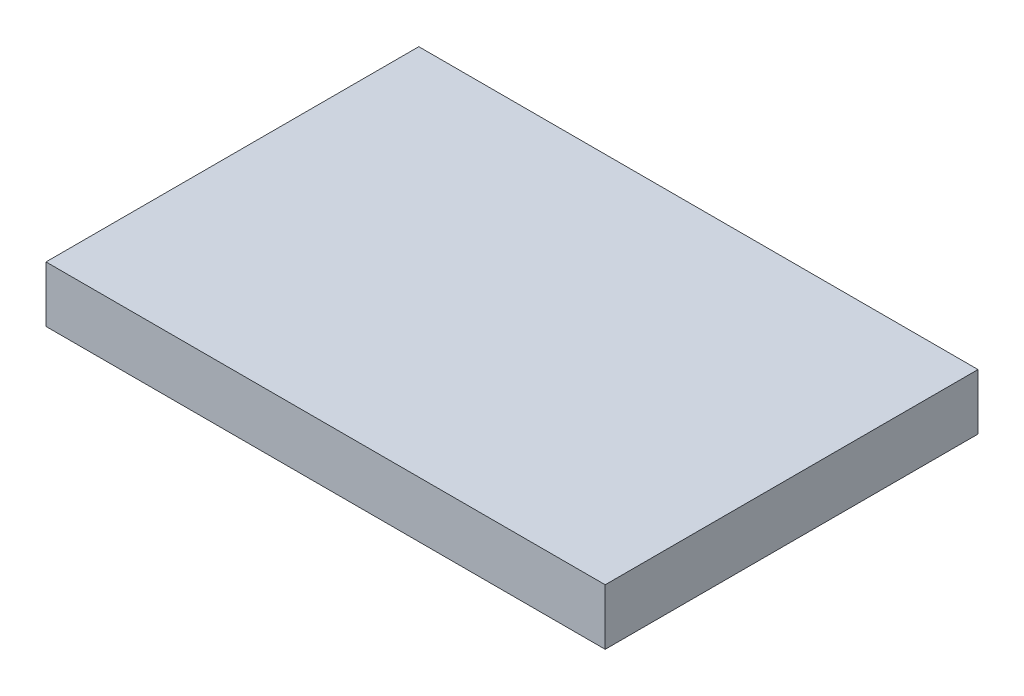
ISO-10303-21;
HEADER;
FILE_DESCRIPTION(('STEP AP214'),'2;1');
FILE_NAME('part.step','',(''),(''),'','','');
FILE_SCHEMA(('AUTOMOTIVE_DESIGN { 1 0 10303 214 1 1 1 1 }'));
ENDSEC;
DATA;
#1=APPLICATION_CONTEXT('core data for automotive mechanical design processes');
#2=APPLICATION_PROTOCOL_DEFINITION('international standard','automotive_design',2000,#1);
#3=PRODUCT_CONTEXT('',#1,'mechanical');
#4=PRODUCT('Part','Part','',(#3));
#5=PRODUCT_RELATED_PRODUCT_CATEGORY('part','',(#4));
#6=PRODUCT_DEFINITION_FORMATION('','',#4);
#7=PRODUCT_DEFINITION_CONTEXT('part definition',#1,'design');
#8=PRODUCT_DEFINITION('design','',#6,#7);
#9=PRODUCT_DEFINITION_SHAPE('','',#8);
#10=(LENGTH_UNIT() NAMED_UNIT(*) SI_UNIT(.MILLI.,.METRE.));
#11=(NAMED_UNIT(*) PLANE_ANGLE_UNIT() SI_UNIT($,.RADIAN.));
#12=(NAMED_UNIT(*) SI_UNIT($,.STERADIAN.) SOLID_ANGLE_UNIT());
#13=UNCERTAINTY_MEASURE_WITH_UNIT(LENGTH_MEASURE(1.E-05),#10,'distance_accuracy_value','');
#14=(GEOMETRIC_REPRESENTATION_CONTEXT(3) GLOBAL_UNCERTAINTY_ASSIGNED_CONTEXT((#13)) GLOBAL_UNIT_ASSIGNED_CONTEXT((#10,
#11,#12)) REPRESENTATION_CONTEXT('',''));
#15=CARTESIAN_POINT('',(0.,0.,0.));
#16=DIRECTION('',(0.,0.,1.));
#17=DIRECTION('',(1.,0.,0.));
#18=AXIS2_PLACEMENT_3D('',#15,#16,#17);
#19=CARTESIAN_POINT('',(15.,3.,10.));
#20=DIRECTION('',(-1.,0.,0.));
#21=DIRECTION('',(0.,0.,1.));
#22=AXIS2_PLACEMENT_3D('',#19,#20,#21);
#23=PLANE('',#22);
#24=DIRECTION('',(0.,0.,-1.));
#25=VECTOR('',#24,1.);
#26=CARTESIAN_POINT('',(15.,0.,10.));
#27=LINE('',#26,#25);
#28=CARTESIAN_POINT('',(15.,0.,10.));
#29=VERTEX_POINT('',#28);
#30=CARTESIAN_POINT('',(15.,0.,-10.));
#31=VERTEX_POINT('',#30);
#32=EDGE_CURVE('E113',#29,#31,#27,.T.);
#33=ORIENTED_EDGE('',*,*,#32,.T.);
#34=DIRECTION('',(0.,-1.,0.));
#35=VECTOR('',#34,1.);
#36=CARTESIAN_POINT('',(15.,3.,-10.));
#37=LINE('',#36,#35);
#38=CARTESIAN_POINT('',(15.,3.,-10.));
#39=VERTEX_POINT('',#38);
#40=EDGE_CURVE('E11',#39,#31,#37,.T.);
#41=ORIENTED_EDGE('',*,*,#40,.F.);
#42=DIRECTION('',(0.,0.,-1.));
#43=VECTOR('',#42,1.);
#44=CARTESIAN_POINT('',(15.,3.,10.));
#45=LINE('',#44,#43);
#46=CARTESIAN_POINT('',(15.,3.,10.));
#47=VERTEX_POINT('',#46);
#48=EDGE_CURVE('E97',#47,#39,#45,.T.);
#49=ORIENTED_EDGE('',*,*,#48,.F.);
#50=DIRECTION('',(0.,-1.,0.));
#51=VECTOR('',#50,1.);
#52=CARTESIAN_POINT('',(15.,3.,10.));
#53=LINE('',#52,#51);
#54=EDGE_CURVE('E109',#47,#29,#53,.T.);
#55=ORIENTED_EDGE('',*,*,#54,.T.);
#56=EDGE_LOOP('',(#33,#41,#49,#55));
#57=FACE_BOUND('',#56,.T.);
#58=ADVANCED_FACE('F45',(#57),#23,.F.);
#59=CARTESIAN_POINT('',(-15.,3.,-10.));
#60=DIRECTION('',(0.,0.,1.));
#61=DIRECTION('',(1.,0.,0.));
#62=AXIS2_PLACEMENT_3D('',#59,#60,#61);
#63=PLANE('',#62);
#64=DIRECTION('',(-1.,0.,0.));
#65=VECTOR('',#64,1.);
#66=CARTESIAN_POINT('',(-15.,0.,-10.));
#67=LINE('',#66,#65);
#68=CARTESIAN_POINT('',(-15.,0.,-10.));
#69=VERTEX_POINT('',#68);
#70=EDGE_CURVE('E102',#31,#69,#67,.T.);
#71=ORIENTED_EDGE('',*,*,#70,.T.);
#72=DIRECTION('',(0.,-1.,0.));
#73=VECTOR('',#72,1.);
#74=CARTESIAN_POINT('',(-15.,3.,-10.));
#75=LINE('',#74,#73);
#76=CARTESIAN_POINT('',(-15.,3.,-10.));
#77=VERTEX_POINT('',#76);
#78=EDGE_CURVE('E54',#77,#69,#75,.T.);
#79=ORIENTED_EDGE('',*,*,#78,.F.);
#80=DIRECTION('',(-1.,0.,0.));
#81=VECTOR('',#80,1.);
#82=CARTESIAN_POINT('',(-15.,3.,-10.));
#83=LINE('',#82,#81);
#84=EDGE_CURVE('E92',#39,#77,#83,.T.);
#85=ORIENTED_EDGE('',*,*,#84,.F.);
#86=ORIENTED_EDGE('',*,*,#40,.T.);
#87=EDGE_LOOP('',(#71,#79,#85,#86));
#88=FACE_BOUND('',#87,.T.);
#89=ADVANCED_FACE('F101',(#88),#63,.F.);
#90=CARTESIAN_POINT('',(-15.,3.,10.));
#91=DIRECTION('',(1.,0.,0.));
#92=DIRECTION('',(0.,0.,-1.));
#93=AXIS2_PLACEMENT_3D('',#90,#91,#92);
#94=PLANE('',#93);
#95=DIRECTION('',(0.,0.,1.));
#96=VECTOR('',#95,1.);
#97=CARTESIAN_POINT('',(-15.,0.,10.));
#98=LINE('',#97,#96);
#99=CARTESIAN_POINT('',(-15.,0.,10.));
#100=VERTEX_POINT('',#99);
#101=EDGE_CURVE('E79',#69,#100,#98,.T.);
#102=ORIENTED_EDGE('',*,*,#101,.T.);
#103=DIRECTION('',(0.,-1.,0.));
#104=VECTOR('',#103,1.);
#105=CARTESIAN_POINT('',(-15.,3.,10.));
#106=LINE('',#105,#104);
#107=CARTESIAN_POINT('',(-15.,3.,10.));
#108=VERTEX_POINT('',#107);
#109=EDGE_CURVE('E104',#108,#100,#106,.T.);
#110=ORIENTED_EDGE('',*,*,#109,.F.);
#111=DIRECTION('',(0.,0.,1.));
#112=VECTOR('',#111,1.);
#113=CARTESIAN_POINT('',(-15.,3.,10.));
#114=LINE('',#113,#112);
#115=EDGE_CURVE('E95',#77,#108,#114,.T.);
#116=ORIENTED_EDGE('',*,*,#115,.F.);
#117=ORIENTED_EDGE('',*,*,#78,.T.);
#118=EDGE_LOOP('',(#102,#110,#116,#117));
#119=FACE_BOUND('',#118,.T.);
#120=ADVANCED_FACE('F105',(#119),#94,.F.);
#121=CARTESIAN_POINT('',(-15.,3.,10.));
#122=DIRECTION('',(0.,0.,-1.));
#123=DIRECTION('',(-1.,0.,0.));
#124=AXIS2_PLACEMENT_3D('',#121,#122,#123);
#125=PLANE('',#124);
#126=DIRECTION('',(1.,0.,0.));
#127=VECTOR('',#126,1.);
#128=CARTESIAN_POINT('',(-15.,0.,10.));
#129=LINE('',#128,#127);
#130=EDGE_CURVE('E85',#100,#29,#129,.T.);
#131=ORIENTED_EDGE('',*,*,#130,.T.);
#132=ORIENTED_EDGE('',*,*,#54,.F.);
#133=DIRECTION('',(1.,0.,0.));
#134=VECTOR('',#133,1.);
#135=CARTESIAN_POINT('',(-15.,3.,10.));
#136=LINE('',#135,#134);
#137=EDGE_CURVE('E62',#108,#47,#136,.T.);
#138=ORIENTED_EDGE('',*,*,#137,.F.);
#139=ORIENTED_EDGE('',*,*,#109,.T.);
#140=EDGE_LOOP('',(#131,#132,#138,#139));
#141=FACE_BOUND('',#140,.T.);
#142=ADVANCED_FACE('F126',(#141),#125,.F.);
#143=CARTESIAN_POINT('',(0.,3.,0.));
#144=DIRECTION('',(0.,-1.,0.));
#145=DIRECTION('',(0.,0.,-1.));
#146=AXIS2_PLACEMENT_3D('',#143,#144,#145);
#147=PLANE('',#146);
#148=ORIENTED_EDGE('',*,*,#48,.T.);
#149=ORIENTED_EDGE('',*,*,#84,.T.);
#150=ORIENTED_EDGE('',*,*,#115,.T.);
#151=ORIENTED_EDGE('',*,*,#137,.T.);
#152=EDGE_LOOP('',(#148,#149,#150,#151));
#153=FACE_BOUND('',#152,.T.);
#154=ADVANCED_FACE('F93',(#153),#147,.F.);
#155=CARTESIAN_POINT('',(0.,0.,0.));
#156=DIRECTION('',(0.,-1.,0.));
#157=DIRECTION('',(0.,0.,-1.));
#158=AXIS2_PLACEMENT_3D('',#155,#156,#157);
#159=PLANE('',#158);
#160=ORIENTED_EDGE('',*,*,#32,.F.);
#161=ORIENTED_EDGE('',*,*,#130,.F.);
#162=ORIENTED_EDGE('',*,*,#101,.F.);
#163=ORIENTED_EDGE('',*,*,#70,.F.);
#164=EDGE_LOOP('',(#160,#161,#162,#163));
#165=FACE_BOUND('',#164,.T.);
#166=ADVANCED_FACE('F129',(#165),#159,.T.);
#167=CLOSED_SHELL('',(#58,#89,#120,#142,#154,#166));
#168=MANIFOLD_SOLID_BREP('B2',#167);
#169=ADVANCED_BREP_SHAPE_REPRESENTATION('',(#18,#168),#14);
#170=SHAPE_DEFINITION_REPRESENTATION(#9,#169);
ENDSEC;
END-ISO-10303-21;
